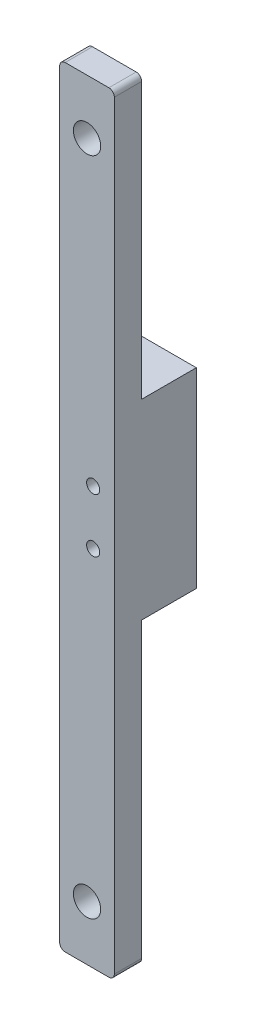
ISO-10303-21;
HEADER;
FILE_DESCRIPTION(('STEP AP214'),'2;1');
FILE_NAME('part.step','',(''),(''),'','','');
FILE_SCHEMA(('AUTOMOTIVE_DESIGN { 1 0 10303 214 1 1 1 1 }'));
ENDSEC;
DATA;
#1=APPLICATION_CONTEXT('core data for automotive mechanical design processes');
#2=APPLICATION_PROTOCOL_DEFINITION('international standard','automotive_design',2000,#1);
#3=PRODUCT_CONTEXT('',#1,'mechanical');
#4=PRODUCT('Part','Part','',(#3));
#5=PRODUCT_RELATED_PRODUCT_CATEGORY('part','',(#4));
#6=PRODUCT_DEFINITION_FORMATION('','',#4);
#7=PRODUCT_DEFINITION_CONTEXT('part definition',#1,'design');
#8=PRODUCT_DEFINITION('design','',#6,#7);
#9=PRODUCT_DEFINITION_SHAPE('','',#8);
#10=(LENGTH_UNIT() NAMED_UNIT(*) SI_UNIT(.MILLI.,.METRE.));
#11=(NAMED_UNIT(*) PLANE_ANGLE_UNIT() SI_UNIT($,.RADIAN.));
#12=(NAMED_UNIT(*) SI_UNIT($,.STERADIAN.) SOLID_ANGLE_UNIT());
#13=UNCERTAINTY_MEASURE_WITH_UNIT(LENGTH_MEASURE(1.E-05),#10,'distance_accuracy_value','');
#14=(GEOMETRIC_REPRESENTATION_CONTEXT(3) GLOBAL_UNCERTAINTY_ASSIGNED_CONTEXT((#13)) GLOBAL_UNIT_ASSIGNED_CONTEXT((#10,
#11,#12)) REPRESENTATION_CONTEXT('',''));
#15=CARTESIAN_POINT('',(0.,0.,0.));
#16=DIRECTION('',(0.,0.,1.));
#17=DIRECTION('',(1.,0.,0.));
#18=AXIS2_PLACEMENT_3D('',#15,#16,#17);
#19=CARTESIAN_POINT('',(0.,0.,0.));
#20=DIRECTION('',(0.,0.,-1.));
#21=DIRECTION('',(-1.,0.,0.));
#22=AXIS2_PLACEMENT_3D('',#19,#20,#21);
#23=PLANE('',#22);
#24=DIRECTION('',(1.,0.,0.));
#25=VECTOR('',#24,1.);
#26=CARTESIAN_POINT('',(0.,0.,0.));
#27=LINE('',#26,#25);
#28=CARTESIAN_POINT('',(1.,0.,0.));
#29=VERTEX_POINT('',#28);
#30=CARTESIAN_POINT('',(9.,0.,0.));
#31=VERTEX_POINT('',#30);
#32=EDGE_CURVE('E204',#29,#31,#27,.T.);
#33=ORIENTED_EDGE('',*,*,#32,.F.);
#34=CARTESIAN_POINT('',(1.,1.,0.));
#35=DIRECTION('',(0.,0.,-1.));
#36=DIRECTION('',(-1.,0.,0.));
#37=AXIS2_PLACEMENT_3D('',#34,#35,#36);
#38=CIRCLE('',#37,1.);
#39=CARTESIAN_POINT('',(0.,1.,0.));
#40=VERTEX_POINT('',#39);
#41=EDGE_CURVE('E223',#29,#40,#38,.T.);
#42=ORIENTED_EDGE('',*,*,#41,.T.);
#43=DIRECTION('',(0.,-1.,0.));
#44=VECTOR('',#43,1.);
#45=CARTESIAN_POINT('',(0.,0.,0.));
#46=LINE('',#45,#44);
#47=CARTESIAN_POINT('',(0.,54.6211184930872,0.));
#48=VERTEX_POINT('',#47);
#49=EDGE_CURVE('E180',#48,#40,#46,.T.);
#50=ORIENTED_EDGE('',*,*,#49,.F.);
#51=DIRECTION('',(-1.,0.,0.));
#52=VECTOR('',#51,1.);
#53=CARTESIAN_POINT('',(0.,54.6211184930872,0.));
#54=LINE('',#53,#52);
#55=CARTESIAN_POINT('',(10.,54.6211184930872,0.));
#56=VERTEX_POINT('',#55);
#57=EDGE_CURVE('E153',#56,#48,#54,.T.);
#58=ORIENTED_EDGE('',*,*,#57,.F.);
#59=DIRECTION('',(0.,1.,0.));
#60=VECTOR('',#59,1.);
#61=CARTESIAN_POINT('',(10.,0.,0.));
#62=LINE('',#61,#60);
#63=CARTESIAN_POINT('',(10.,1.,0.));
#64=VERTEX_POINT('',#63);
#65=EDGE_CURVE('E209',#64,#56,#62,.T.);
#66=ORIENTED_EDGE('',*,*,#65,.F.);
#67=CARTESIAN_POINT('',(9.,1.,0.));
#68=DIRECTION('',(0.,0.,-1.));
#69=DIRECTION('',(-1.,0.,0.));
#70=AXIS2_PLACEMENT_3D('',#67,#68,#69);
#71=CIRCLE('',#70,1.);
#72=EDGE_CURVE('E220',#64,#31,#71,.T.);
#73=ORIENTED_EDGE('',*,*,#72,.T.);
#74=EDGE_LOOP('',(#33,#42,#50,#58,#66,#73));
#75=FACE_BOUND('',#74,.T.);
#76=CARTESIAN_POINT('',(5.,10.,0.));
#77=DIRECTION('',(0.,0.,1.));
#78=DIRECTION('',(1.,0.,0.));
#79=AXIS2_PLACEMENT_3D('',#76,#77,#78);
#80=CIRCLE('',#79,2.5);
#81=CARTESIAN_POINT('',(7.5,10.,0.));
#82=VERTEX_POINT('',#81);
#83=EDGE_CURVE('E161',#82,#82,#80,.T.);
#84=ORIENTED_EDGE('',*,*,#83,.T.);
#85=EDGE_LOOP('',(#84));
#86=FACE_BOUND('',#85,.T.);
#87=ADVANCED_FACE('F40',(#75,#86),#23,.T.);
#88=CARTESIAN_POINT('',(0.,0.,5.));
#89=DIRECTION('',(0.,0.,-1.));
#90=DIRECTION('',(-1.,0.,0.));
#91=AXIS2_PLACEMENT_3D('',#88,#89,#90);
#92=PLANE('',#91);
#93=CARTESIAN_POINT('',(6.11819393275317,66.494048401976,5.));
#94=DIRECTION('',(0.,0.,-1.));
#95=DIRECTION('',(-1.,0.,0.));
#96=AXIS2_PLACEMENT_3D('',#93,#94,#95);
#97=CIRCLE('',#96,1.2);
#98=CARTESIAN_POINT('',(4.91819393275317,66.494048401976,5.));
#99=VERTEX_POINT('',#98);
#100=EDGE_CURVE('E305',#99,#99,#97,.T.);
#101=ORIENTED_EDGE('',*,*,#100,.T.);
#102=EDGE_LOOP('',(#101));
#103=FACE_BOUND('',#102,.T.);
#104=CARTESIAN_POINT('',(6.1181939327532,76.394048401976,5.));
#105=DIRECTION('',(0.,0.,-1.));
#106=DIRECTION('',(-1.,0.,0.));
#107=AXIS2_PLACEMENT_3D('',#104,#105,#106);
#108=CIRCLE('',#107,1.2);
#109=CARTESIAN_POINT('',(4.9181939327532,76.394048401976,5.));
#110=VERTEX_POINT('',#109);
#111=EDGE_CURVE('E313',#110,#110,#108,.T.);
#112=ORIENTED_EDGE('',*,*,#111,.T.);
#113=EDGE_LOOP('',(#112));
#114=FACE_BOUND('',#113,.T.);
#115=DIRECTION('',(0.,-1.,0.));
#116=VECTOR('',#115,1.);
#117=CARTESIAN_POINT('',(0.,0.,5.));
#118=LINE('',#117,#116);
#119=CARTESIAN_POINT('',(0.,140.,5.));
#120=VERTEX_POINT('',#119);
#121=CARTESIAN_POINT('',(0.,1.,5.));
#122=VERTEX_POINT('',#121);
#123=EDGE_CURVE('E184',#120,#122,#118,.T.);
#124=ORIENTED_EDGE('',*,*,#123,.T.);
#125=CARTESIAN_POINT('',(1.,1.,5.));
#126=DIRECTION('',(0.,0.,-1.));
#127=DIRECTION('',(-1.,0.,0.));
#128=AXIS2_PLACEMENT_3D('',#125,#126,#127);
#129=CIRCLE('',#128,1.);
#130=CARTESIAN_POINT('',(1.,0.,5.));
#131=VERTEX_POINT('',#130);
#132=EDGE_CURVE('E241',#122,#131,#129,.F.);
#133=ORIENTED_EDGE('',*,*,#132,.T.);
#134=DIRECTION('',(1.,0.,0.));
#135=VECTOR('',#134,1.);
#136=CARTESIAN_POINT('',(0.,0.,5.));
#137=LINE('',#136,#135);
#138=CARTESIAN_POINT('',(9.,0.,5.));
#139=VERTEX_POINT('',#138);
#140=EDGE_CURVE('E188',#131,#139,#137,.T.);
#141=ORIENTED_EDGE('',*,*,#140,.T.);
#142=CARTESIAN_POINT('',(9.,1.,5.));
#143=DIRECTION('',(0.,0.,-1.));
#144=DIRECTION('',(-1.,0.,0.));
#145=AXIS2_PLACEMENT_3D('',#142,#143,#144);
#146=CIRCLE('',#145,1.);
#147=CARTESIAN_POINT('',(10.,1.,5.));
#148=VERTEX_POINT('',#147);
#149=EDGE_CURVE('E238',#139,#148,#146,.F.);
#150=ORIENTED_EDGE('',*,*,#149,.T.);
#151=DIRECTION('',(0.,1.,0.));
#152=VECTOR('',#151,1.);
#153=CARTESIAN_POINT('',(10.,0.,5.));
#154=LINE('',#153,#152);
#155=CARTESIAN_POINT('',(10.,140.,5.));
#156=VERTEX_POINT('',#155);
#157=EDGE_CURVE('E193',#148,#156,#154,.T.);
#158=ORIENTED_EDGE('',*,*,#157,.T.);
#159=CARTESIAN_POINT('',(9.,140.,5.));
#160=DIRECTION('',(0.,0.,-1.));
#161=DIRECTION('',(-1.,0.,0.));
#162=AXIS2_PLACEMENT_3D('',#159,#160,#161);
#163=CIRCLE('',#162,1.);
#164=CARTESIAN_POINT('',(9.,141.,5.));
#165=VERTEX_POINT('',#164);
#166=EDGE_CURVE('E232',#156,#165,#163,.F.);
#167=ORIENTED_EDGE('',*,*,#166,.T.);
#168=DIRECTION('',(-1.,0.,0.));
#169=VECTOR('',#168,1.);
#170=CARTESIAN_POINT('',(0.,141.,5.));
#171=LINE('',#170,#169);
#172=CARTESIAN_POINT('',(1.,141.,5.));
#173=VERTEX_POINT('',#172);
#174=EDGE_CURVE('E197',#165,#173,#171,.T.);
#175=ORIENTED_EDGE('',*,*,#174,.T.);
#176=CARTESIAN_POINT('',(1.,140.,5.));
#177=DIRECTION('',(0.,0.,-1.));
#178=DIRECTION('',(-1.,0.,0.));
#179=AXIS2_PLACEMENT_3D('',#176,#177,#178);
#180=CIRCLE('',#179,1.);
#181=EDGE_CURVE('E235',#173,#120,#180,.F.);
#182=ORIENTED_EDGE('',*,*,#181,.T.);
#183=EDGE_LOOP('',(#124,#133,#141,#150,#158,#167,#175,#182));
#184=FACE_BOUND('',#183,.T.);
#185=CARTESIAN_POINT('',(5.,131.,5.));
#186=DIRECTION('',(0.,0.,1.));
#187=DIRECTION('',(1.,0.,0.));
#188=AXIS2_PLACEMENT_3D('',#185,#186,#187);
#189=CIRCLE('',#188,2.5);
#190=CARTESIAN_POINT('',(7.5,131.,5.));
#191=VERTEX_POINT('',#190);
#192=EDGE_CURVE('E176',#191,#191,#189,.T.);
#193=ORIENTED_EDGE('',*,*,#192,.F.);
#194=EDGE_LOOP('',(#193));
#195=FACE_BOUND('',#194,.T.);
#196=CARTESIAN_POINT('',(5.,10.,5.));
#197=DIRECTION('',(0.,0.,1.));
#198=DIRECTION('',(1.,0.,0.));
#199=AXIS2_PLACEMENT_3D('',#196,#197,#198);
#200=CIRCLE('',#199,2.5);
#201=CARTESIAN_POINT('',(7.5,10.,5.));
#202=VERTEX_POINT('',#201);
#203=EDGE_CURVE('E166',#202,#202,#200,.T.);
#204=ORIENTED_EDGE('',*,*,#203,.F.);
#205=EDGE_LOOP('',(#204));
#206=FACE_BOUND('',#205,.T.);
#207=ADVANCED_FACE('F268',(#103,#114,#184,#195,#206),#92,.F.);
#208=CARTESIAN_POINT('',(0.,140.,0.));
#209=VERTEX_POINT('',#208);
#210=CARTESIAN_POINT('',(0.,89.6211184930872,0.));
#211=VERTEX_POINT('',#210);
#212=EDGE_CURVE('E158',#209,#211,#46,.T.);
#213=ORIENTED_EDGE('',*,*,#212,.F.);
#214=CARTESIAN_POINT('',(1.,140.,0.));
#215=DIRECTION('',(0.,0.,-1.));
#216=DIRECTION('',(-1.,0.,0.));
#217=AXIS2_PLACEMENT_3D('',#214,#215,#216);
#218=CIRCLE('',#217,1.);
#219=CARTESIAN_POINT('',(1.,141.,0.));
#220=VERTEX_POINT('',#219);
#221=EDGE_CURVE('E56',#209,#220,#218,.T.);
#222=ORIENTED_EDGE('',*,*,#221,.T.);
#223=DIRECTION('',(-1.,0.,0.));
#224=VECTOR('',#223,1.);
#225=CARTESIAN_POINT('',(0.,141.,0.));
#226=LINE('',#225,#224);
#227=CARTESIAN_POINT('',(9.,141.,0.));
#228=VERTEX_POINT('',#227);
#229=EDGE_CURVE('E189',#228,#220,#226,.T.);
#230=ORIENTED_EDGE('',*,*,#229,.F.);
#231=CARTESIAN_POINT('',(9.,140.,0.));
#232=DIRECTION('',(0.,0.,-1.));
#233=DIRECTION('',(-1.,0.,0.));
#234=AXIS2_PLACEMENT_3D('',#231,#232,#233);
#235=CIRCLE('',#234,1.);
#236=CARTESIAN_POINT('',(10.,140.,0.));
#237=VERTEX_POINT('',#236);
#238=EDGE_CURVE('E64',#228,#237,#235,.T.);
#239=ORIENTED_EDGE('',*,*,#238,.T.);
#240=CARTESIAN_POINT('',(10.,89.6211184930872,0.));
#241=VERTEX_POINT('',#240);
#242=EDGE_CURVE('E208',#241,#237,#62,.T.);
#243=ORIENTED_EDGE('',*,*,#242,.F.);
#244=DIRECTION('',(1.,0.,0.));
#245=VECTOR('',#244,1.);
#246=CARTESIAN_POINT('',(0.,89.6211184930872,0.));
#247=LINE('',#246,#245);
#248=EDGE_CURVE('E303',#211,#241,#247,.T.);
#249=ORIENTED_EDGE('',*,*,#248,.F.);
#250=EDGE_LOOP('',(#213,#222,#230,#239,#243,#249));
#251=FACE_BOUND('',#250,.T.);
#252=CARTESIAN_POINT('',(5.,131.,0.));
#253=DIRECTION('',(0.,0.,1.));
#254=DIRECTION('',(1.,0.,0.));
#255=AXIS2_PLACEMENT_3D('',#252,#253,#254);
#256=CIRCLE('',#255,2.5);
#257=CARTESIAN_POINT('',(7.5,131.,0.));
#258=VERTEX_POINT('',#257);
#259=EDGE_CURVE('E174',#258,#258,#256,.T.);
#260=ORIENTED_EDGE('',*,*,#259,.T.);
#261=EDGE_LOOP('',(#260));
#262=FACE_BOUND('',#261,.T.);
#263=ADVANCED_FACE('F260',(#251,#262),#23,.T.);
#264=CARTESIAN_POINT('',(0.,0.,5.));
#265=DIRECTION('',(1.,0.,0.));
#266=DIRECTION('',(0.,0.,-1.));
#267=AXIS2_PLACEMENT_3D('',#264,#265,#266);
#268=PLANE('',#267);
#269=ORIENTED_EDGE('',*,*,#49,.T.);
#270=DIRECTION('',(0.,0.,-1.));
#271=VECTOR('',#270,1.);
#272=CARTESIAN_POINT('',(0.,1.,5.));
#273=LINE('',#272,#271);
#274=EDGE_CURVE('E229',#40,#122,#273,.F.);
#275=ORIENTED_EDGE('',*,*,#274,.T.);
#276=ORIENTED_EDGE('',*,*,#123,.F.);
#277=DIRECTION('',(0.,0.,-1.));
#278=VECTOR('',#277,1.);
#279=CARTESIAN_POINT('',(0.,140.,5.));
#280=LINE('',#279,#278);
#281=EDGE_CURVE('E226',#120,#209,#280,.T.);
#282=ORIENTED_EDGE('',*,*,#281,.T.);
#283=ORIENTED_EDGE('',*,*,#212,.T.);
#284=DIRECTION('',(0.,0.,1.));
#285=VECTOR('',#284,1.);
#286=CARTESIAN_POINT('',(0.,89.6211184930872,-10.));
#287=LINE('',#286,#285);
#288=CARTESIAN_POINT('',(0.,89.6211184930872,-10.));
#289=VERTEX_POINT('',#288);
#290=EDGE_CURVE('E136',#289,#211,#287,.T.);
#291=ORIENTED_EDGE('',*,*,#290,.F.);
#292=DIRECTION('',(0.,1.,0.));
#293=VECTOR('',#292,1.);
#294=CARTESIAN_POINT('',(0.,89.6211184930872,-10.));
#295=LINE('',#294,#293);
#296=CARTESIAN_POINT('',(0.,54.6211184930872,-10.));
#297=VERTEX_POINT('',#296);
#298=EDGE_CURVE('E143',#297,#289,#295,.T.);
#299=ORIENTED_EDGE('',*,*,#298,.F.);
#300=DIRECTION('',(0.,0.,1.));
#301=VECTOR('',#300,1.);
#302=CARTESIAN_POINT('',(0.,54.6211184930872,-10.));
#303=LINE('',#302,#301);
#304=EDGE_CURVE('E291',#297,#48,#303,.T.);
#305=ORIENTED_EDGE('',*,*,#304,.T.);
#306=EDGE_LOOP('',(#269,#275,#276,#282,#283,#291,#299,#305));
#307=FACE_BOUND('',#306,.T.);
#308=ADVANCED_FACE('F156',(#307),#268,.F.);
#309=CARTESIAN_POINT('',(0.,0.,5.));
#310=DIRECTION('',(0.,1.,0.));
#311=DIRECTION('',(0.,0.,1.));
#312=AXIS2_PLACEMENT_3D('',#309,#310,#311);
#313=PLANE('',#312);
#314=ORIENTED_EDGE('',*,*,#140,.F.);
#315=DIRECTION('',(0.,0.,-1.));
#316=VECTOR('',#315,1.);
#317=CARTESIAN_POINT('',(1.,0.,5.));
#318=LINE('',#317,#316);
#319=EDGE_CURVE('E216',#131,#29,#318,.T.);
#320=ORIENTED_EDGE('',*,*,#319,.T.);
#321=ORIENTED_EDGE('',*,*,#32,.T.);
#322=DIRECTION('',(0.,0.,-1.));
#323=VECTOR('',#322,1.);
#324=CARTESIAN_POINT('',(9.,0.,5.));
#325=LINE('',#324,#323);
#326=EDGE_CURVE('E201',#31,#139,#325,.F.);
#327=ORIENTED_EDGE('',*,*,#326,.T.);
#328=EDGE_LOOP('',(#314,#320,#321,#327));
#329=FACE_BOUND('',#328,.T.);
#330=ADVANCED_FACE('F283',(#329),#313,.F.);
#331=CARTESIAN_POINT('',(10.,0.,5.));
#332=DIRECTION('',(-1.,0.,0.));
#333=DIRECTION('',(0.,0.,1.));
#334=AXIS2_PLACEMENT_3D('',#331,#332,#333);
#335=PLANE('',#334);
#336=ORIENTED_EDGE('',*,*,#157,.F.);
#337=DIRECTION('',(0.,0.,-1.));
#338=VECTOR('',#337,1.);
#339=CARTESIAN_POINT('',(10.,1.,5.));
#340=LINE('',#339,#338);
#341=EDGE_CURVE('E247',#148,#64,#340,.T.);
#342=ORIENTED_EDGE('',*,*,#341,.T.);
#343=ORIENTED_EDGE('',*,*,#65,.T.);
#344=DIRECTION('',(0.,0.,1.));
#345=VECTOR('',#344,1.);
#346=CARTESIAN_POINT('',(10.,54.6211184930872,-10.));
#347=LINE('',#346,#345);
#348=CARTESIAN_POINT('',(10.,54.6211184930872,-10.));
#349=VERTEX_POINT('',#348);
#350=EDGE_CURVE('E168',#349,#56,#347,.T.);
#351=ORIENTED_EDGE('',*,*,#350,.F.);
#352=DIRECTION('',(0.,-1.,0.));
#353=VECTOR('',#352,1.);
#354=CARTESIAN_POINT('',(10.,89.6211184930872,-10.));
#355=LINE('',#354,#353);
#356=CARTESIAN_POINT('',(10.,89.6211184930872,-10.));
#357=VERTEX_POINT('',#356);
#358=EDGE_CURVE('E142',#357,#349,#355,.T.);
#359=ORIENTED_EDGE('',*,*,#358,.F.);
#360=DIRECTION('',(0.,0.,1.));
#361=VECTOR('',#360,1.);
#362=CARTESIAN_POINT('',(10.,89.6211184930872,-10.));
#363=LINE('',#362,#361);
#364=EDGE_CURVE('E138',#357,#241,#363,.T.);
#365=ORIENTED_EDGE('',*,*,#364,.T.);
#366=ORIENTED_EDGE('',*,*,#242,.T.);
#367=DIRECTION('',(0.,0.,-1.));
#368=VECTOR('',#367,1.);
#369=CARTESIAN_POINT('',(10.,140.,5.));
#370=LINE('',#369,#368);
#371=EDGE_CURVE('E244',#237,#156,#370,.F.);
#372=ORIENTED_EDGE('',*,*,#371,.T.);
#373=EDGE_LOOP('',(#336,#342,#343,#351,#359,#365,#366,#372));
#374=FACE_BOUND('',#373,.T.);
#375=ADVANCED_FACE('F265',(#374),#335,.F.);
#376=CARTESIAN_POINT('',(0.,141.,5.));
#377=DIRECTION('',(0.,-1.,0.));
#378=DIRECTION('',(0.,0.,-1.));
#379=AXIS2_PLACEMENT_3D('',#376,#377,#378);
#380=PLANE('',#379);
#381=ORIENTED_EDGE('',*,*,#229,.T.);
#382=DIRECTION('',(0.,0.,-1.));
#383=VECTOR('',#382,1.);
#384=CARTESIAN_POINT('',(1.,141.,5.));
#385=LINE('',#384,#383);
#386=EDGE_CURVE('E11',#220,#173,#385,.F.);
#387=ORIENTED_EDGE('',*,*,#386,.T.);
#388=ORIENTED_EDGE('',*,*,#174,.F.);
#389=DIRECTION('',(0.,0.,-1.));
#390=VECTOR('',#389,1.);
#391=CARTESIAN_POINT('',(9.,141.,5.));
#392=LINE('',#391,#390);
#393=EDGE_CURVE('E49',#165,#228,#392,.T.);
#394=ORIENTED_EDGE('',*,*,#393,.T.);
#395=EDGE_LOOP('',(#381,#387,#388,#394));
#396=FACE_BOUND('',#395,.T.);
#397=ADVANCED_FACE('F257',(#396),#380,.F.);
#398=CARTESIAN_POINT('',(5.,131.,5.));
#399=DIRECTION('',(0.,0.,-1.));
#400=DIRECTION('',(-1.,0.,0.));
#401=AXIS2_PLACEMENT_3D('',#398,#399,#400);
#402=CYLINDRICAL_SURFACE('',#401,2.5);
#403=ORIENTED_EDGE('',*,*,#192,.T.);
#404=EDGE_LOOP('',(#403));
#405=FACE_BOUND('',#404,.T.);
#406=ORIENTED_EDGE('',*,*,#259,.F.);
#407=EDGE_LOOP('',(#406));
#408=FACE_BOUND('',#407,.T.);
#409=ADVANCED_FACE('F402',(#405,#408),#402,.F.);
#410=CARTESIAN_POINT('',(5.,10.,5.));
#411=DIRECTION('',(0.,0.,-1.));
#412=DIRECTION('',(-1.,0.,0.));
#413=AXIS2_PLACEMENT_3D('',#410,#411,#412);
#414=CYLINDRICAL_SURFACE('',#413,2.5);
#415=ORIENTED_EDGE('',*,*,#203,.T.);
#416=EDGE_LOOP('',(#415));
#417=FACE_BOUND('',#416,.T.);
#418=ORIENTED_EDGE('',*,*,#83,.F.);
#419=EDGE_LOOP('',(#418));
#420=FACE_BOUND('',#419,.T.);
#421=ADVANCED_FACE('F469',(#417,#420),#414,.F.);
#422=CARTESIAN_POINT('',(0.,89.6211184930872,-10.));
#423=DIRECTION('',(0.,-1.,0.));
#424=DIRECTION('',(0.,0.,-1.));
#425=AXIS2_PLACEMENT_3D('',#422,#423,#424);
#426=PLANE('',#425);
#427=ORIENTED_EDGE('',*,*,#248,.T.);
#428=ORIENTED_EDGE('',*,*,#364,.F.);
#429=DIRECTION('',(1.,0.,0.));
#430=VECTOR('',#429,1.);
#431=CARTESIAN_POINT('',(0.,89.6211184930872,-10.));
#432=LINE('',#431,#430);
#433=EDGE_CURVE('E131',#289,#357,#432,.T.);
#434=ORIENTED_EDGE('',*,*,#433,.F.);
#435=ORIENTED_EDGE('',*,*,#290,.T.);
#436=EDGE_LOOP('',(#427,#428,#434,#435));
#437=FACE_BOUND('',#436,.T.);
#438=ADVANCED_FACE('F134',(#437),#426,.F.);
#439=CARTESIAN_POINT('',(0.,54.6211184930872,-10.));
#440=DIRECTION('',(0.,1.,0.));
#441=DIRECTION('',(0.,0.,1.));
#442=AXIS2_PLACEMENT_3D('',#439,#440,#441);
#443=PLANE('',#442);
#444=ORIENTED_EDGE('',*,*,#57,.T.);
#445=ORIENTED_EDGE('',*,*,#304,.F.);
#446=DIRECTION('',(-1.,0.,0.));
#447=VECTOR('',#446,1.);
#448=CARTESIAN_POINT('',(0.,54.6211184930872,-10.));
#449=LINE('',#448,#447);
#450=EDGE_CURVE('E148',#349,#297,#449,.T.);
#451=ORIENTED_EDGE('',*,*,#450,.F.);
#452=ORIENTED_EDGE('',*,*,#350,.T.);
#453=EDGE_LOOP('',(#444,#445,#451,#452));
#454=FACE_BOUND('',#453,.T.);
#455=ADVANCED_FACE('F336',(#454),#443,.F.);
#456=CARTESIAN_POINT('',(0.,0.,-10.));
#457=DIRECTION('',(0.,0.,1.));
#458=DIRECTION('',(1.,0.,0.));
#459=AXIS2_PLACEMENT_3D('',#456,#457,#458);
#460=PLANE('',#459);
#461=CARTESIAN_POINT('',(6.11819393275317,66.494048401976,-10.));
#462=DIRECTION('',(0.,0.,-1.));
#463=DIRECTION('',(-1.,0.,0.));
#464=AXIS2_PLACEMENT_3D('',#461,#462,#463);
#465=CIRCLE('',#464,1.2);
#466=CARTESIAN_POINT('',(4.91819393275317,66.494048401976,-10.));
#467=VERTEX_POINT('',#466);
#468=EDGE_CURVE('E317',#467,#467,#465,.T.);
#469=ORIENTED_EDGE('',*,*,#468,.F.);
#470=EDGE_LOOP('',(#469));
#471=FACE_BOUND('',#470,.T.);
#472=CARTESIAN_POINT('',(6.1181939327532,76.394048401976,-10.));
#473=DIRECTION('',(0.,0.,-1.));
#474=DIRECTION('',(-1.,0.,0.));
#475=AXIS2_PLACEMENT_3D('',#472,#473,#474);
#476=CIRCLE('',#475,1.2);
#477=CARTESIAN_POINT('',(4.9181939327532,76.394048401976,-10.));
#478=VERTEX_POINT('',#477);
#479=EDGE_CURVE('E309',#478,#478,#476,.T.);
#480=ORIENTED_EDGE('',*,*,#479,.F.);
#481=EDGE_LOOP('',(#480));
#482=FACE_BOUND('',#481,.T.);
#483=ORIENTED_EDGE('',*,*,#298,.T.);
#484=ORIENTED_EDGE('',*,*,#433,.T.);
#485=ORIENTED_EDGE('',*,*,#358,.T.);
#486=ORIENTED_EDGE('',*,*,#450,.T.);
#487=EDGE_LOOP('',(#483,#484,#485,#486));
#488=FACE_BOUND('',#487,.T.);
#489=ADVANCED_FACE('F146',(#471,#482,#488),#460,.F.);
#490=CARTESIAN_POINT('',(6.1181939327532,76.394048401976,5.));
#491=DIRECTION('',(0.,0.,-1.));
#492=DIRECTION('',(-1.,0.,0.));
#493=AXIS2_PLACEMENT_3D('',#490,#491,#492);
#494=CYLINDRICAL_SURFACE('',#493,1.2);
#495=ORIENTED_EDGE('',*,*,#111,.F.);
#496=EDGE_LOOP('',(#495));
#497=FACE_BOUND('',#496,.T.);
#498=ORIENTED_EDGE('',*,*,#479,.T.);
#499=EDGE_LOOP('',(#498));
#500=FACE_BOUND('',#499,.T.);
#501=ADVANCED_FACE('F330',(#497,#500),#494,.F.);
#502=CARTESIAN_POINT('',(6.11819393275317,66.494048401976,5.));
#503=DIRECTION('',(0.,0.,-1.));
#504=DIRECTION('',(-1.,0.,0.));
#505=AXIS2_PLACEMENT_3D('',#502,#503,#504);
#506=CYLINDRICAL_SURFACE('',#505,1.2);
#507=ORIENTED_EDGE('',*,*,#100,.F.);
#508=EDGE_LOOP('',(#507));
#509=FACE_BOUND('',#508,.T.);
#510=ORIENTED_EDGE('',*,*,#468,.T.);
#511=EDGE_LOOP('',(#510));
#512=FACE_BOUND('',#511,.T.);
#513=ADVANCED_FACE('F327',(#509,#512),#506,.F.);
#514=CARTESIAN_POINT('',(1.,1.,5.));
#515=DIRECTION('',(0.,0.,-1.));
#516=DIRECTION('',(-1.,0.,0.));
#517=AXIS2_PLACEMENT_3D('',#514,#515,#516);
#518=CYLINDRICAL_SURFACE('',#517,1.);
#519=ORIENTED_EDGE('',*,*,#132,.F.);
#520=ORIENTED_EDGE('',*,*,#274,.F.);
#521=ORIENTED_EDGE('',*,*,#41,.F.);
#522=ORIENTED_EDGE('',*,*,#319,.F.);
#523=EDGE_LOOP('',(#519,#520,#521,#522));
#524=FACE_BOUND('',#523,.T.);
#525=ADVANCED_FACE('F287',(#524),#518,.T.);
#526=CARTESIAN_POINT('',(9.,1.,5.));
#527=DIRECTION('',(0.,0.,-1.));
#528=DIRECTION('',(-1.,0.,0.));
#529=AXIS2_PLACEMENT_3D('',#526,#527,#528);
#530=CYLINDRICAL_SURFACE('',#529,1.);
#531=ORIENTED_EDGE('',*,*,#149,.F.);
#532=ORIENTED_EDGE('',*,*,#326,.F.);
#533=ORIENTED_EDGE('',*,*,#72,.F.);
#534=ORIENTED_EDGE('',*,*,#341,.F.);
#535=EDGE_LOOP('',(#531,#532,#533,#534));
#536=FACE_BOUND('',#535,.T.);
#537=ADVANCED_FACE('F275',(#536),#530,.T.);
#538=CARTESIAN_POINT('',(1.,140.,5.));
#539=DIRECTION('',(0.,0.,-1.));
#540=DIRECTION('',(-1.,0.,0.));
#541=AXIS2_PLACEMENT_3D('',#538,#539,#540);
#542=CYLINDRICAL_SURFACE('',#541,1.);
#543=ORIENTED_EDGE('',*,*,#181,.F.);
#544=ORIENTED_EDGE('',*,*,#386,.F.);
#545=ORIENTED_EDGE('',*,*,#221,.F.);
#546=ORIENTED_EDGE('',*,*,#281,.F.);
#547=EDGE_LOOP('',(#543,#544,#545,#546));
#548=FACE_BOUND('',#547,.T.);
#549=ADVANCED_FACE('F367',(#548),#542,.T.);
#550=CARTESIAN_POINT('',(9.,140.,5.));
#551=DIRECTION('',(0.,0.,-1.));
#552=DIRECTION('',(-1.,0.,0.));
#553=AXIS2_PLACEMENT_3D('',#550,#551,#552);
#554=CYLINDRICAL_SURFACE('',#553,1.);
#555=ORIENTED_EDGE('',*,*,#166,.F.);
#556=ORIENTED_EDGE('',*,*,#371,.F.);
#557=ORIENTED_EDGE('',*,*,#238,.F.);
#558=ORIENTED_EDGE('',*,*,#393,.F.);
#559=EDGE_LOOP('',(#555,#556,#557,#558));
#560=FACE_BOUND('',#559,.T.);
#561=ADVANCED_FACE('F42',(#560),#554,.T.);
#562=CLOSED_SHELL('',(#87,#207,#263,#308,#330,#375,#397,#409,#421,#438,#455,#489,#501,#513,#525,
#537,#549,#561));
#563=MANIFOLD_SOLID_BREP('B2',#562);
#564=ADVANCED_BREP_SHAPE_REPRESENTATION('',(#18,#563),#14);
#565=SHAPE_DEFINITION_REPRESENTATION(#9,#564);
ENDSEC;
END-ISO-10303-21;
